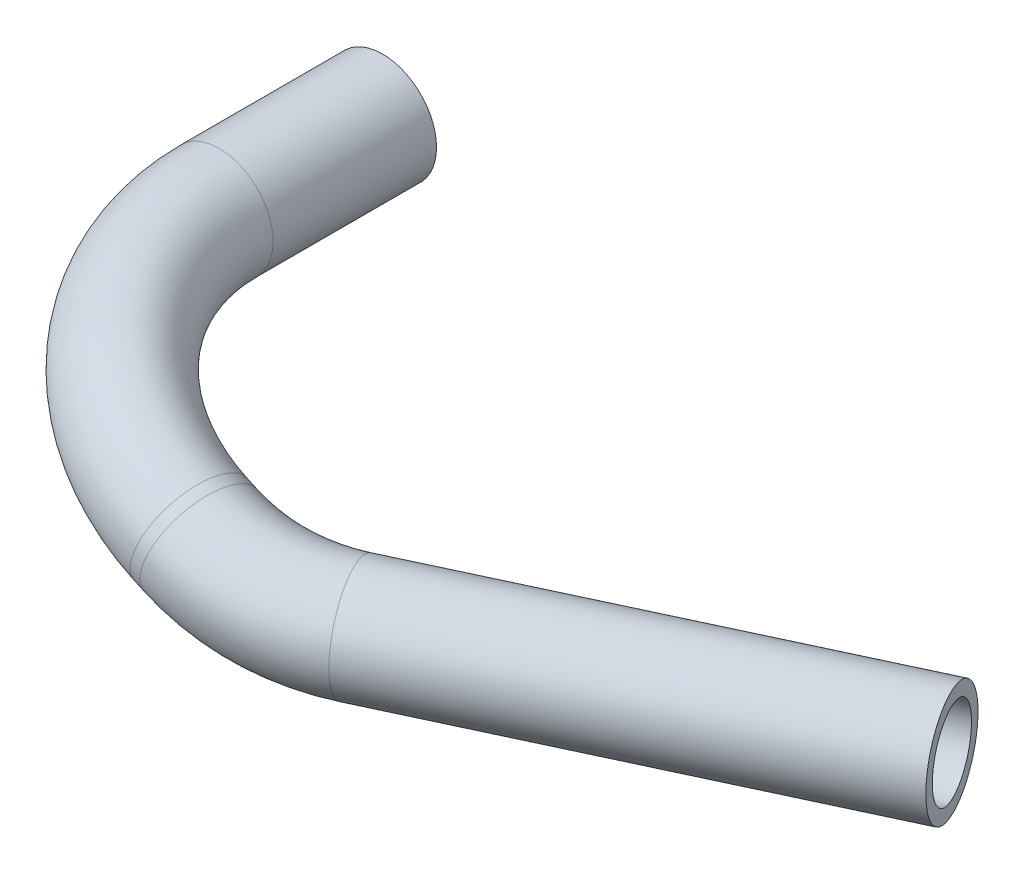
ISO-10303-21;
HEADER;
FILE_DESCRIPTION(('STEP AP214'),'2;1');
FILE_NAME('part.step','',(''),(''),'','','');
FILE_SCHEMA(('AUTOMOTIVE_DESIGN { 1 0 10303 214 1 1 1 1 }'));
ENDSEC;
DATA;
#1=APPLICATION_CONTEXT('core data for automotive mechanical design processes');
#2=APPLICATION_PROTOCOL_DEFINITION('international standard','automotive_design',2000,#1);
#3=PRODUCT_CONTEXT('',#1,'mechanical');
#4=PRODUCT('Part','Part','',(#3));
#5=PRODUCT_RELATED_PRODUCT_CATEGORY('part','',(#4));
#6=PRODUCT_DEFINITION_FORMATION('','',#4);
#7=PRODUCT_DEFINITION_CONTEXT('part definition',#1,'design');
#8=PRODUCT_DEFINITION('design','',#6,#7);
#9=PRODUCT_DEFINITION_SHAPE('','',#8);
#10=(LENGTH_UNIT() NAMED_UNIT(*) SI_UNIT(.MILLI.,.METRE.));
#11=(NAMED_UNIT(*) PLANE_ANGLE_UNIT() SI_UNIT($,.RADIAN.));
#12=(NAMED_UNIT(*) SI_UNIT($,.STERADIAN.) SOLID_ANGLE_UNIT());
#13=UNCERTAINTY_MEASURE_WITH_UNIT(LENGTH_MEASURE(1.E-05),#10,'distance_accuracy_value','');
#14=(GEOMETRIC_REPRESENTATION_CONTEXT(3) GLOBAL_UNCERTAINTY_ASSIGNED_CONTEXT((#13)) GLOBAL_UNIT_ASSIGNED_CONTEXT((#10,
#11,#12)) REPRESENTATION_CONTEXT('',''));
#15=CARTESIAN_POINT('',(0.,0.,0.));
#16=DIRECTION('',(0.,0.,1.));
#17=DIRECTION('',(1.,0.,0.));
#18=AXIS2_PLACEMENT_3D('',#15,#16,#17);
#19=CARTESIAN_POINT('',(29.9144157811974,-8.00000000000023,32.3625700376569));
#20=DIRECTION('',(0.90642434554373,0.,-0.422368211168433));
#21=DIRECTION('',(-0.422368211168433,0.,-0.90642434554373));
#22=AXIS2_PLACEMENT_3D('',#19,#20,#21);
#23=CYLINDRICAL_SURFACE('',#22,4.765);
#24=CARTESIAN_POINT('',(29.9144157811974,-8.00000000000023,32.3625700376569));
#25=DIRECTION('',(0.906424345543729,0.,-0.422368211168434));
#26=DIRECTION('',(-0.39273879338714,0.367940544857428,-0.842838060138977));
#27=AXIS2_PLACEMENT_3D('',#24,#25,#26);
#28=CIRCLE('',#27,4.765);
#29=CARTESIAN_POINT('',(31.5980083151019,-10.6108253628831,35.9756479643433));
#30=VERTEX_POINT('',#29);
#31=EDGE_CURVE('E39',#30,#30,#28,.T.);
#32=ORIENTED_EDGE('',*,*,#31,.T.);
#33=EDGE_LOOP('',(#32));
#34=FACE_BOUND('',#33,.T.);
#35=CARTESIAN_POINT('',(65.9383760669005,-8.00000000000023,15.5764193347563));
#36=DIRECTION('',(0.906424345543729,0.,-0.422368211168434));
#37=DIRECTION('',(-0.39273879338714,0.367940544857428,-0.842838060138977));
#38=AXIS2_PLACEMENT_3D('',#35,#36,#37);
#39=CIRCLE('',#38,4.765);
#40=CARTESIAN_POINT('',(64.0669757164108,-6.24676330375458,11.5602959781941));
#41=VERTEX_POINT('',#40);
#42=EDGE_CURVE('E10',#41,#41,#39,.T.);
#43=ORIENTED_EDGE('',*,*,#42,.F.);
#44=EDGE_LOOP('',(#43));
#45=FACE_BOUND('',#44,.T.);
#46=ADVANCED_FACE('F29',(#34,#45),#23,.T.);
#47=CARTESIAN_POINT('',(29.9144157811974,-8.00000000000023,32.3625700376569));
#48=DIRECTION('',(0.90642434554373,0.,-0.422368211168433));
#49=DIRECTION('',(-0.422368211168433,0.,-0.90642434554373));
#50=AXIS2_PLACEMENT_3D('',#47,#48,#49);
#51=CYLINDRICAL_SURFACE('',#50,3.58);
#52=CARTESIAN_POINT('',(29.9144157811974,-8.00000000000023,32.3625700376569));
#53=DIRECTION('',(0.906424345543729,0.,-0.422368211168434));
#54=DIRECTION('',(-0.39273879338714,0.367940544857428,-0.842838060138977));
#55=AXIS2_PLACEMENT_3D('',#52,#53,#54);
#56=CIRCLE('',#55,3.58);
#57=CARTESIAN_POINT('',(31.1793184614447,-9.96154350453759,35.0771175670456));
#58=VERTEX_POINT('',#57);
#59=EDGE_CURVE('E43',#58,#58,#56,.T.);
#60=ORIENTED_EDGE('',*,*,#59,.F.);
#61=EDGE_LOOP('',(#60));
#62=FACE_BOUND('',#61,.T.);
#63=CARTESIAN_POINT('',(65.9383760669005,-8.00000000000023,15.5764193347563));
#64=DIRECTION('',(0.906424345543729,0.,-0.422368211168434));
#65=DIRECTION('',(-0.39273879338714,0.367940544857428,-0.842838060138977));
#66=AXIS2_PLACEMENT_3D('',#63,#64,#65);
#67=CIRCLE('',#66,3.58);
#68=CARTESIAN_POINT('',(64.5323711865745,-6.68277284941064,12.5590590794588));
#69=VERTEX_POINT('',#68);
#70=EDGE_CURVE('E35',#69,#69,#67,.T.);
#71=ORIENTED_EDGE('',*,*,#70,.T.);
#72=EDGE_LOOP('',(#71));
#73=FACE_BOUND('',#72,.T.);
#74=ADVANCED_FACE('F97',(#62,#73),#51,.F.);
#75=CARTESIAN_POINT('',(22.8479203608218,2.95834360076717,17.1975000410716));
#76=DIRECTION('',(0.231422799201258,0.836532583835681,0.496645471328445));
#77=DIRECTION('',(0.,-0.510503984352683,0.85987538746032));
#78=AXIS2_PLACEMENT_3D('',#75,#76,#77);
#79=TOROIDAL_SURFACE('',#78,20.,4.765);
#80=CARTESIAN_POINT('',(18.3244451455237,-6.0467139516387,34.4731218954201));
#81=DIRECTION('',(0.946197081982034,-0.312226812390999,0.0850029392011863));
#82=DIRECTION('',(0.174851158826855,0.272283224429253,-0.946197081982034));
#83=AXIS2_PLACEMENT_3D('',#80,#81,#82);
#84=CIRCLE('',#83,4.765);
#85=CARTESIAN_POINT('',(17.246727175479,-8.19216891349939,38.5890388022186));
#86=VERTEX_POINT('',#85);
#87=EDGE_CURVE('E48',#86,#86,#84,.T.);
#88=CARTESIAN_POINT('',(22.8479203608218,2.95834360076717,17.1975000410716));
#89=DIRECTION('',(0.231422799201258,0.836532583835681,0.496645471328445));
#90=DIRECTION('',(0.,-0.510503984352683,0.85987538746032));
#91=AXIS2_PLACEMENT_3D('',#88,#89,#90);
#92=CIRCLE('',#91,24.765);
#93=EDGE_CURVE('',#86,#30,#92,.T.);
#94=ORIENTED_EDGE('',*,*,#87,.T.);
#95=ORIENTED_EDGE('',*,*,#31,.F.);
#96=ORIENTED_EDGE('',*,*,#93,.T.);
#97=ORIENTED_EDGE('',*,*,#93,.F.);
#98=EDGE_LOOP('',(#94,#96,#95,#97));
#99=FACE_BOUND('',#98,.T.);
#100=ADVANCED_FACE('F93',(#99),#79,.T.);
#101=CARTESIAN_POINT('',(22.8479203608218,2.95834360076717,17.1975000410716));
#102=DIRECTION('',(0.231422799201258,0.836532583835681,0.496645471328445));
#103=DIRECTION('',(0.,-0.510503984352683,0.85987538746032));
#104=AXIS2_PLACEMENT_3D('',#101,#102,#103);
#105=TOROIDAL_SURFACE('',#104,20.,3.58);
#106=CARTESIAN_POINT('',(18.3244451455237,-6.0467139516387,34.4731218954201));
#107=DIRECTION('',(0.946197081982034,-0.312226812390999,0.0850029392011863));
#108=DIRECTION('',(0.174851158826855,0.272283224429253,-0.946197081982034));
#109=AXIS2_PLACEMENT_3D('',#106,#107,#108);
#110=CIRCLE('',#109,3.58);
#111=CARTESIAN_POINT('',(17.5147430819854,-7.65861925351935,37.5654582073485));
#112=VERTEX_POINT('',#111);
#113=EDGE_CURVE('E51',#112,#112,#110,.T.);
#114=CARTESIAN_POINT('',(22.8479203608218,2.95834360076717,17.1975000410716));
#115=DIRECTION('',(0.231422799201258,0.836532583835681,0.496645471328445));
#116=DIRECTION('',(0.,-0.510503984352683,0.85987538746032));
#117=AXIS2_PLACEMENT_3D('',#114,#115,#116);
#118=CIRCLE('',#117,23.58);
#119=EDGE_CURVE('',#112,#58,#118,.T.);
#120=ORIENTED_EDGE('',*,*,#113,.F.);
#121=ORIENTED_EDGE('',*,*,#59,.T.);
#122=ORIENTED_EDGE('',*,*,#119,.T.);
#123=ORIENTED_EDGE('',*,*,#119,.F.);
#124=EDGE_LOOP('',(#120,#122,#121,#123));
#125=FACE_BOUND('',#124,.T.);
#126=ADVANCED_FACE('F90',(#125),#105,.F.);
#127=CARTESIAN_POINT('',(17.3782480635417,-5.7344871392477,34.3881189562189));
#128=DIRECTION('',(0.946197081982035,-0.312226812390998,0.0850029392011764));
#129=DIRECTION('',(0.313360959555506,0.949634092177852,0.));
#130=AXIS2_PLACEMENT_3D('',#127,#128,#129);
#131=CYLINDRICAL_SURFACE('',#130,4.765);
#132=CARTESIAN_POINT('',(17.3782480635417,-5.7344871392477,34.3881189562189));
#133=DIRECTION('',(0.946197081982034,-0.312226812390999,0.0850029392011863));
#134=DIRECTION('',(0.174851158826855,0.272283224429253,-0.946197081982034));
#135=AXIS2_PLACEMENT_3D('',#132,#133,#134);
#136=CIRCLE('',#135,4.765);
#137=CARTESIAN_POINT('',(16.993609215453,-5.60756372789148,39.1358729940973));
#138=VERTEX_POINT('',#137);
#139=EDGE_CURVE('E54',#138,#138,#136,.T.);
#140=ORIENTED_EDGE('',*,*,#139,.T.);
#141=EDGE_LOOP('',(#140));
#142=FACE_BOUND('',#141,.T.);
#143=ORIENTED_EDGE('',*,*,#87,.F.);
#144=EDGE_LOOP('',(#143));
#145=FACE_BOUND('',#144,.T.);
#146=ADVANCED_FACE('F86',(#142,#145),#131,.T.);
#147=CARTESIAN_POINT('',(17.3782480635417,-5.7344871392477,34.3881189562189));
#148=DIRECTION('',(0.946197081982035,-0.312226812390998,0.0850029392011764));
#149=DIRECTION('',(0.313360959555506,0.949634092177852,0.));
#150=AXIS2_PLACEMENT_3D('',#147,#148,#149);
#151=CYLINDRICAL_SURFACE('',#150,3.58);
#152=CARTESIAN_POINT('',(17.3782480635417,-5.7344871392477,34.3881189562189));
#153=DIRECTION('',(0.946197081982034,-0.312226812390999,0.0850029392011863));
#154=DIRECTION('',(0.174851158826855,0.272283224429253,-0.946197081982034));
#155=AXIS2_PLACEMENT_3D('',#152,#153,#154);
#156=CIRCLE('',#155,3.58);
#157=CARTESIAN_POINT('',(17.0892644169189,-5.63912810196433,37.9551618640059));
#158=VERTEX_POINT('',#157);
#159=EDGE_CURVE('E57',#158,#158,#156,.T.);
#160=ORIENTED_EDGE('',*,*,#159,.F.);
#161=EDGE_LOOP('',(#160));
#162=FACE_BOUND('',#161,.T.);
#163=ORIENTED_EDGE('',*,*,#113,.T.);
#164=EDGE_LOOP('',(#163));
#165=FACE_BOUND('',#164,.T.);
#166=ADVANCED_FACE('F83',(#162,#165),#151,.F.);
#167=CARTESIAN_POINT('',(18.992681843557,-6.26721919111015,14.4605049462361));
#168=DIRECTION('',(0.313360959555507,0.949634092177851,0.));
#169=DIRECTION('',(-0.949634092177851,0.313360959555507,0.));
#170=AXIS2_PLACEMENT_3D('',#167,#168,#169);
#171=TOROIDAL_SURFACE('',#170,20.,4.765);
#172=CARTESIAN_POINT('',(0.,0.,14.4605049462361));
#173=DIRECTION('',(0.,0.,1.));
#174=DIRECTION('',(1.,0.,0.));
#175=AXIS2_PLACEMENT_3D('',#172,#173,#174);
#176=CIRCLE('',#175,4.765);
#177=CARTESIAN_POINT('',(-4.52500644922746,1.49316497228199,14.4605049462361));
#178=VERTEX_POINT('',#177);
#179=EDGE_CURVE('E60',#178,#178,#176,.T.);
#180=CARTESIAN_POINT('',(18.992681843557,-6.26721919111015,14.4605049462361));
#181=DIRECTION('',(0.313360959555507,0.949634092177851,0.));
#182=DIRECTION('',(-0.949634092177851,0.313360959555507,0.));
#183=AXIS2_PLACEMENT_3D('',#180,#181,#182);
#184=CIRCLE('',#183,24.765);
#185=EDGE_CURVE('',#178,#138,#184,.T.);
#186=ORIENTED_EDGE('',*,*,#179,.T.);
#187=ORIENTED_EDGE('',*,*,#139,.F.);
#188=ORIENTED_EDGE('',*,*,#185,.T.);
#189=ORIENTED_EDGE('',*,*,#185,.F.);
#190=EDGE_LOOP('',(#186,#188,#187,#189));
#191=FACE_BOUND('',#190,.T.);
#192=ADVANCED_FACE('F79',(#191),#171,.T.);
#193=CARTESIAN_POINT('',(18.992681843557,-6.26721919111015,14.4605049462361));
#194=DIRECTION('',(0.313360959555507,0.949634092177851,0.));
#195=DIRECTION('',(-0.949634092177851,0.313360959555507,0.));
#196=AXIS2_PLACEMENT_3D('',#193,#194,#195);
#197=TOROIDAL_SURFACE('',#196,20.,3.58);
#198=CARTESIAN_POINT('',(0.,0.,14.4605049462361));
#199=DIRECTION('',(0.,0.,1.));
#200=DIRECTION('',(1.,0.,0.));
#201=AXIS2_PLACEMENT_3D('',#198,#199,#200);
#202=CIRCLE('',#201,3.58);
#203=CARTESIAN_POINT('',(-3.39969004999671,1.12183223520872,14.4605049462361));
#204=VERTEX_POINT('',#203);
#205=EDGE_CURVE('E64',#204,#204,#202,.T.);
#206=CARTESIAN_POINT('',(18.992681843557,-6.26721919111015,14.4605049462361));
#207=DIRECTION('',(0.313360959555507,0.949634092177851,0.));
#208=DIRECTION('',(-0.949634092177851,0.313360959555507,0.));
#209=AXIS2_PLACEMENT_3D('',#206,#207,#208);
#210=CIRCLE('',#209,23.58);
#211=EDGE_CURVE('',#204,#158,#210,.T.);
#212=ORIENTED_EDGE('',*,*,#205,.F.);
#213=ORIENTED_EDGE('',*,*,#159,.T.);
#214=ORIENTED_EDGE('',*,*,#211,.T.);
#215=ORIENTED_EDGE('',*,*,#211,.F.);
#216=EDGE_LOOP('',(#212,#214,#213,#215));
#217=FACE_BOUND('',#216,.T.);
#218=ADVANCED_FACE('F76',(#217),#197,.F.);
#219=CARTESIAN_POINT('',(0.,0.,14.4605049462361));
#220=DIRECTION('',(0.,0.,-1.));
#221=DIRECTION('',(0.,1.,0.));
#222=AXIS2_PLACEMENT_3D('',#219,#220,#221);
#223=CYLINDRICAL_SURFACE('',#222,3.58);
#224=ORIENTED_EDGE('',*,*,#205,.T.);
#225=EDGE_LOOP('',(#224));
#226=FACE_BOUND('',#225,.T.);
#227=CARTESIAN_POINT('',(0.,0.,0.));
#228=DIRECTION('',(0.,0.,1.));
#229=DIRECTION('',(1.,0.,0.));
#230=AXIS2_PLACEMENT_3D('',#227,#228,#229);
#231=CIRCLE('',#230,3.58);
#232=CARTESIAN_POINT('',(3.58,0.,0.));
#233=VERTEX_POINT('',#232);
#234=EDGE_CURVE('E65',#233,#233,#231,.T.);
#235=ORIENTED_EDGE('',*,*,#234,.F.);
#236=EDGE_LOOP('',(#235));
#237=FACE_BOUND('',#236,.T.);
#238=ADVANCED_FACE('F73',(#226,#237),#223,.F.);
#239=CARTESIAN_POINT('',(0.,0.,14.4605049462361));
#240=DIRECTION('',(0.,0.,-1.));
#241=DIRECTION('',(0.,1.,0.));
#242=AXIS2_PLACEMENT_3D('',#239,#240,#241);
#243=CYLINDRICAL_SURFACE('',#242,4.765);
#244=ORIENTED_EDGE('',*,*,#179,.F.);
#245=EDGE_LOOP('',(#244));
#246=FACE_BOUND('',#245,.T.);
#247=CARTESIAN_POINT('',(0.,0.,0.));
#248=DIRECTION('',(0.,0.,1.));
#249=DIRECTION('',(1.,0.,0.));
#250=AXIS2_PLACEMENT_3D('',#247,#248,#249);
#251=CIRCLE('',#250,4.765);
#252=CARTESIAN_POINT('',(4.765,0.,0.));
#253=VERTEX_POINT('',#252);
#254=EDGE_CURVE('E61',#253,#253,#251,.T.);
#255=ORIENTED_EDGE('',*,*,#254,.T.);
#256=EDGE_LOOP('',(#255));
#257=FACE_BOUND('',#256,.T.);
#258=ADVANCED_FACE('F115',(#246,#257),#243,.T.);
#259=CARTESIAN_POINT('',(65.9383760669005,-8.00000000000023,15.5764193347563));
#260=DIRECTION('',(0.906424345543729,0.,-0.422368211168434));
#261=DIRECTION('',(-0.39273879338714,0.367940544857428,-0.842838060138977));
#262=AXIS2_PLACEMENT_3D('',#259,#260,#261);
#263=PLANE('',#262);
#264=ORIENTED_EDGE('',*,*,#70,.F.);
#265=EDGE_LOOP('',(#264));
#266=FACE_BOUND('',#265,.T.);
#267=ORIENTED_EDGE('',*,*,#42,.T.);
#268=EDGE_LOOP('',(#267));
#269=FACE_BOUND('',#268,.T.);
#270=ADVANCED_FACE('F118',(#266,#269),#263,.T.);
#271=CARTESIAN_POINT('',(0.,0.,0.));
#272=DIRECTION('',(0.,0.,1.));
#273=DIRECTION('',(1.,0.,0.));
#274=AXIS2_PLACEMENT_3D('',#271,#272,#273);
#275=PLANE('',#274);
#276=ORIENTED_EDGE('',*,*,#234,.T.);
#277=EDGE_LOOP('',(#276));
#278=FACE_BOUND('',#277,.T.);
#279=ORIENTED_EDGE('',*,*,#254,.F.);
#280=EDGE_LOOP('',(#279));
#281=FACE_BOUND('',#280,.T.);
#282=ADVANCED_FACE('F120',(#278,#281),#275,.F.);
#283=CLOSED_SHELL('',(#46,#74,#100,#126,#146,#166,#192,#218,#238,#258,#270,#282));
#284=MANIFOLD_SOLID_BREP('B2',#283);
#285=ADVANCED_BREP_SHAPE_REPRESENTATION('',(#18,#284),#14);
#286=SHAPE_DEFINITION_REPRESENTATION(#9,#285);
ENDSEC;
END-ISO-10303-21;
